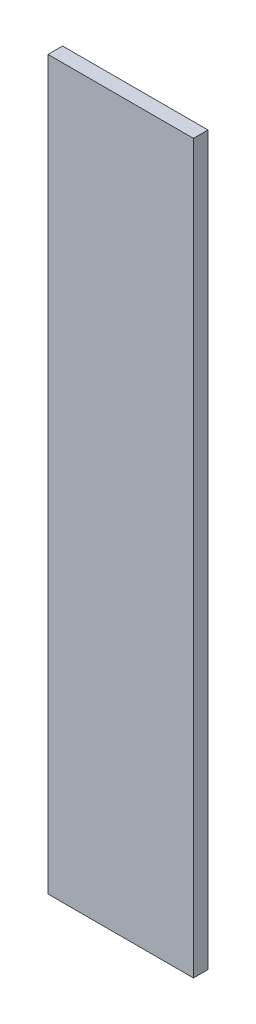
ISO-10303-21;
HEADER;
FILE_DESCRIPTION(('STEP AP214'),'2;1');
FILE_NAME('part.step','',(''),(''),'','','');
FILE_SCHEMA(('AUTOMOTIVE_DESIGN { 1 0 10303 214 1 1 1 1 }'));
ENDSEC;
DATA;
#1=APPLICATION_CONTEXT('core data for automotive mechanical design processes');
#2=APPLICATION_PROTOCOL_DEFINITION('international standard','automotive_design',2000,#1);
#3=PRODUCT_CONTEXT('',#1,'mechanical');
#4=PRODUCT('Part','Part','',(#3));
#5=PRODUCT_RELATED_PRODUCT_CATEGORY('part','',(#4));
#6=PRODUCT_DEFINITION_FORMATION('','',#4);
#7=PRODUCT_DEFINITION_CONTEXT('part definition',#1,'design');
#8=PRODUCT_DEFINITION('design','',#6,#7);
#9=PRODUCT_DEFINITION_SHAPE('','',#8);
#10=(LENGTH_UNIT() NAMED_UNIT(*) SI_UNIT(.MILLI.,.METRE.));
#11=(NAMED_UNIT(*) PLANE_ANGLE_UNIT() SI_UNIT($,.RADIAN.));
#12=(NAMED_UNIT(*) SI_UNIT($,.STERADIAN.) SOLID_ANGLE_UNIT());
#13=UNCERTAINTY_MEASURE_WITH_UNIT(LENGTH_MEASURE(1.E-05),#10,'distance_accuracy_value','');
#14=(GEOMETRIC_REPRESENTATION_CONTEXT(3) GLOBAL_UNCERTAINTY_ASSIGNED_CONTEXT((#13)) GLOBAL_UNIT_ASSIGNED_CONTEXT((#10,
#11,#12)) REPRESENTATION_CONTEXT('',''));
#15=CARTESIAN_POINT('',(0.,0.,0.));
#16=DIRECTION('',(0.,0.,1.));
#17=DIRECTION('',(1.,0.,0.));
#18=AXIS2_PLACEMENT_3D('',#15,#16,#17);
#19=CARTESIAN_POINT('',(5.,-25.,1.));
#20=DIRECTION('',(-1.,0.,0.));
#21=DIRECTION('',(0.,0.,1.));
#22=AXIS2_PLACEMENT_3D('',#19,#20,#21);
#23=PLANE('',#22);
#24=DIRECTION('',(0.,1.,0.));
#25=VECTOR('',#24,1.);
#26=CARTESIAN_POINT('',(5.,-25.,0.));
#27=LINE('',#26,#25);
#28=CARTESIAN_POINT('',(5.,-25.,0.));
#29=VERTEX_POINT('',#28);
#30=CARTESIAN_POINT('',(5.,25.,0.));
#31=VERTEX_POINT('',#30);
#32=EDGE_CURVE('E96',#29,#31,#27,.T.);
#33=ORIENTED_EDGE('',*,*,#32,.T.);
#34=DIRECTION('',(0.,0.,-1.));
#35=VECTOR('',#34,1.);
#36=CARTESIAN_POINT('',(5.,25.,1.));
#37=LINE('',#36,#35);
#38=CARTESIAN_POINT('',(5.,25.,1.));
#39=VERTEX_POINT('',#38);
#40=EDGE_CURVE('E11',#39,#31,#37,.T.);
#41=ORIENTED_EDGE('',*,*,#40,.F.);
#42=DIRECTION('',(0.,1.,0.));
#43=VECTOR('',#42,1.);
#44=CARTESIAN_POINT('',(5.,-25.,1.));
#45=LINE('',#44,#43);
#46=CARTESIAN_POINT('',(5.,-25.,1.));
#47=VERTEX_POINT('',#46);
#48=EDGE_CURVE('E84',#47,#39,#45,.T.);
#49=ORIENTED_EDGE('',*,*,#48,.F.);
#50=DIRECTION('',(0.,0.,-1.));
#51=VECTOR('',#50,1.);
#52=CARTESIAN_POINT('',(5.,-25.,1.));
#53=LINE('',#52,#51);
#54=EDGE_CURVE('E92',#47,#29,#53,.T.);
#55=ORIENTED_EDGE('',*,*,#54,.T.);
#56=EDGE_LOOP('',(#33,#41,#49,#55));
#57=FACE_BOUND('',#56,.T.);
#58=ADVANCED_FACE('F33',(#57),#23,.F.);
#59=CARTESIAN_POINT('',(-5.,25.,1.));
#60=DIRECTION('',(0.,-1.,0.));
#61=DIRECTION('',(0.,0.,-1.));
#62=AXIS2_PLACEMENT_3D('',#59,#60,#61);
#63=PLANE('',#62);
#64=DIRECTION('',(-1.,0.,0.));
#65=VECTOR('',#64,1.);
#66=CARTESIAN_POINT('',(-5.,25.,0.));
#67=LINE('',#66,#65);
#68=CARTESIAN_POINT('',(-5.,25.,0.));
#69=VERTEX_POINT('',#68);
#70=EDGE_CURVE('E88',#31,#69,#67,.T.);
#71=ORIENTED_EDGE('',*,*,#70,.T.);
#72=DIRECTION('',(0.,0.,-1.));
#73=VECTOR('',#72,1.);
#74=CARTESIAN_POINT('',(-5.,25.,1.));
#75=LINE('',#74,#73);
#76=CARTESIAN_POINT('',(-5.,25.,1.));
#77=VERTEX_POINT('',#76);
#78=EDGE_CURVE('E41',#77,#69,#75,.T.);
#79=ORIENTED_EDGE('',*,*,#78,.F.);
#80=DIRECTION('',(-1.,0.,0.));
#81=VECTOR('',#80,1.);
#82=CARTESIAN_POINT('',(-5.,25.,1.));
#83=LINE('',#82,#81);
#84=EDGE_CURVE('E79',#39,#77,#83,.T.);
#85=ORIENTED_EDGE('',*,*,#84,.F.);
#86=ORIENTED_EDGE('',*,*,#40,.T.);
#87=EDGE_LOOP('',(#71,#79,#85,#86));
#88=FACE_BOUND('',#87,.T.);
#89=ADVANCED_FACE('F87',(#88),#63,.F.);
#90=CARTESIAN_POINT('',(-5.,-25.,1.));
#91=DIRECTION('',(1.,0.,0.));
#92=DIRECTION('',(0.,0.,-1.));
#93=AXIS2_PLACEMENT_3D('',#90,#91,#92);
#94=PLANE('',#93);
#95=DIRECTION('',(0.,-1.,0.));
#96=VECTOR('',#95,1.);
#97=CARTESIAN_POINT('',(-5.,-25.,0.));
#98=LINE('',#97,#96);
#99=CARTESIAN_POINT('',(-5.,-25.,0.));
#100=VERTEX_POINT('',#99);
#101=EDGE_CURVE('E66',#69,#100,#98,.T.);
#102=ORIENTED_EDGE('',*,*,#101,.T.);
#103=DIRECTION('',(0.,0.,-1.));
#104=VECTOR('',#103,1.);
#105=CARTESIAN_POINT('',(-5.,-25.,1.));
#106=LINE('',#105,#104);
#107=CARTESIAN_POINT('',(-5.,-25.,1.));
#108=VERTEX_POINT('',#107);
#109=EDGE_CURVE('E89',#108,#100,#106,.T.);
#110=ORIENTED_EDGE('',*,*,#109,.F.);
#111=DIRECTION('',(0.,-1.,0.));
#112=VECTOR('',#111,1.);
#113=CARTESIAN_POINT('',(-5.,-25.,1.));
#114=LINE('',#113,#112);
#115=EDGE_CURVE('E82',#77,#108,#114,.T.);
#116=ORIENTED_EDGE('',*,*,#115,.F.);
#117=ORIENTED_EDGE('',*,*,#78,.T.);
#118=EDGE_LOOP('',(#102,#110,#116,#117));
#119=FACE_BOUND('',#118,.T.);
#120=ADVANCED_FACE('F90',(#119),#94,.F.);
#121=CARTESIAN_POINT('',(-5.,-25.,1.));
#122=DIRECTION('',(0.,1.,0.));
#123=DIRECTION('',(0.,0.,1.));
#124=AXIS2_PLACEMENT_3D('',#121,#122,#123);
#125=PLANE('',#124);
#126=DIRECTION('',(1.,0.,0.));
#127=VECTOR('',#126,1.);
#128=CARTESIAN_POINT('',(-5.,-25.,0.));
#129=LINE('',#128,#127);
#130=EDGE_CURVE('E72',#100,#29,#129,.T.);
#131=ORIENTED_EDGE('',*,*,#130,.T.);
#132=ORIENTED_EDGE('',*,*,#54,.F.);
#133=DIRECTION('',(1.,0.,0.));
#134=VECTOR('',#133,1.);
#135=CARTESIAN_POINT('',(-5.,-25.,1.));
#136=LINE('',#135,#134);
#137=EDGE_CURVE('E49',#108,#47,#136,.T.);
#138=ORIENTED_EDGE('',*,*,#137,.F.);
#139=ORIENTED_EDGE('',*,*,#109,.T.);
#140=EDGE_LOOP('',(#131,#132,#138,#139));
#141=FACE_BOUND('',#140,.T.);
#142=ADVANCED_FACE('F103',(#141),#125,.F.);
#143=CARTESIAN_POINT('',(0.,0.,1.));
#144=DIRECTION('',(0.,0.,-1.));
#145=DIRECTION('',(-1.,0.,0.));
#146=AXIS2_PLACEMENT_3D('',#143,#144,#145);
#147=PLANE('',#146);
#148=ORIENTED_EDGE('',*,*,#48,.T.);
#149=ORIENTED_EDGE('',*,*,#84,.T.);
#150=ORIENTED_EDGE('',*,*,#115,.T.);
#151=ORIENTED_EDGE('',*,*,#137,.T.);
#152=EDGE_LOOP('',(#148,#149,#150,#151));
#153=FACE_BOUND('',#152,.T.);
#154=ADVANCED_FACE('F80',(#153),#147,.F.);
#155=CARTESIAN_POINT('',(0.,0.,0.));
#156=DIRECTION('',(0.,0.,-1.));
#157=DIRECTION('',(-1.,0.,0.));
#158=AXIS2_PLACEMENT_3D('',#155,#156,#157);
#159=PLANE('',#158);
#160=ORIENTED_EDGE('',*,*,#32,.F.);
#161=ORIENTED_EDGE('',*,*,#130,.F.);
#162=ORIENTED_EDGE('',*,*,#101,.F.);
#163=ORIENTED_EDGE('',*,*,#70,.F.);
#164=EDGE_LOOP('',(#160,#161,#162,#163));
#165=FACE_BOUND('',#164,.T.);
#166=ADVANCED_FACE('F106',(#165),#159,.T.);
#167=CLOSED_SHELL('',(#58,#89,#120,#142,#154,#166));
#168=MANIFOLD_SOLID_BREP('B2',#167);
#169=ADVANCED_BREP_SHAPE_REPRESENTATION('',(#18,#168),#14);
#170=SHAPE_DEFINITION_REPRESENTATION(#9,#169);
ENDSEC;
END-ISO-10303-21;
